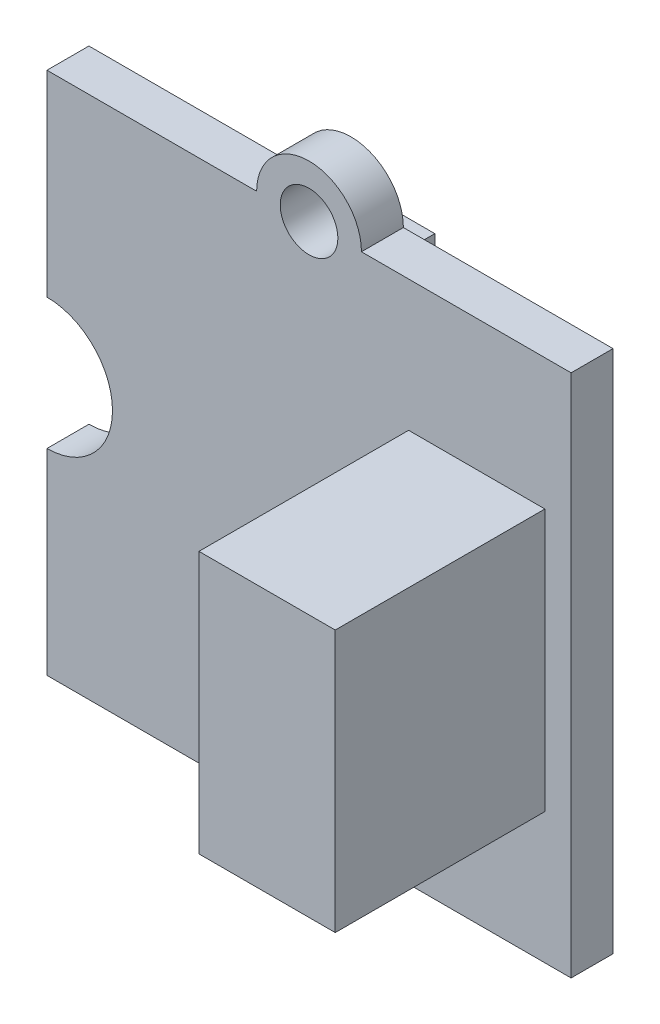
ISO-10303-21;
HEADER;
FILE_DESCRIPTION(('STEP AP214'),'2;1');
FILE_NAME('part.step','',(''),(''),'','','');
FILE_SCHEMA(('AUTOMOTIVE_DESIGN { 1 0 10303 214 1 1 1 1 }'));
ENDSEC;
DATA;
#1=APPLICATION_CONTEXT('core data for automotive mechanical design processes');
#2=APPLICATION_PROTOCOL_DEFINITION('international standard','automotive_design',2000,#1);
#3=PRODUCT_CONTEXT('',#1,'mechanical');
#4=PRODUCT('Part','Part','',(#3));
#5=PRODUCT_RELATED_PRODUCT_CATEGORY('part','',(#4));
#6=PRODUCT_DEFINITION_FORMATION('','',#4);
#7=PRODUCT_DEFINITION_CONTEXT('part definition',#1,'design');
#8=PRODUCT_DEFINITION('design','',#6,#7);
#9=PRODUCT_DEFINITION_SHAPE('','',#8);
#10=(LENGTH_UNIT() NAMED_UNIT(*) SI_UNIT(.MILLI.,.METRE.));
#11=(NAMED_UNIT(*) PLANE_ANGLE_UNIT() SI_UNIT($,.RADIAN.));
#12=(NAMED_UNIT(*) SI_UNIT($,.STERADIAN.) SOLID_ANGLE_UNIT());
#13=UNCERTAINTY_MEASURE_WITH_UNIT(LENGTH_MEASURE(1.E-05),#10,'distance_accuracy_value','');
#14=(GEOMETRIC_REPRESENTATION_CONTEXT(3) GLOBAL_UNCERTAINTY_ASSIGNED_CONTEXT((#13)) GLOBAL_UNIT_ASSIGNED_CONTEXT((#10,
#11,#12)) REPRESENTATION_CONTEXT('',''));
#15=CARTESIAN_POINT('',(0.,0.,0.));
#16=DIRECTION('',(0.,0.,1.));
#17=DIRECTION('',(1.,0.,0.));
#18=AXIS2_PLACEMENT_3D('',#15,#16,#17);
#19=CARTESIAN_POINT('',(0.,0.,1.6));
#20=DIRECTION('',(0.,0.,1.));
#21=DIRECTION('',(1.,0.,0.));
#22=AXIS2_PLACEMENT_3D('',#19,#20,#21);
#23=PLANE('',#22);
#24=CARTESIAN_POINT('',(-10.,0.,1.6));
#25=DIRECTION('',(0.,0.,1.));
#26=DIRECTION('',(1.,0.,0.));
#27=AXIS2_PLACEMENT_3D('',#24,#25,#26);
#28=CIRCLE('',#27,1.1);
#29=CARTESIAN_POINT('',(-8.9,0.,1.6));
#30=VERTEX_POINT('',#29);
#31=EDGE_CURVE('E226',#30,#30,#28,.T.);
#32=ORIENTED_EDGE('',*,*,#31,.F.);
#33=EDGE_LOOP('',(#32));
#34=FACE_BOUND('',#33,.T.);
#35=CARTESIAN_POINT('',(-10.,20.,1.6));
#36=DIRECTION('',(0.,0.,1.));
#37=DIRECTION('',(1.,0.,0.));
#38=AXIS2_PLACEMENT_3D('',#35,#36,#37);
#39=CIRCLE('',#38,2.);
#40=CARTESIAN_POINT('',(-8.,20.,1.6));
#41=VERTEX_POINT('',#40);
#42=CARTESIAN_POINT('',(-12.,20.,1.6));
#43=VERTEX_POINT('',#42);
#44=EDGE_CURVE('E229',#41,#43,#39,.T.);
#45=ORIENTED_EDGE('',*,*,#44,.T.);
#46=DIRECTION('',(-1.,0.,0.));
#47=VECTOR('',#46,1.);
#48=CARTESIAN_POINT('',(0.,20.,1.6));
#49=LINE('',#48,#47);
#50=CARTESIAN_POINT('',(-20.,20.,1.6));
#51=VERTEX_POINT('',#50);
#52=EDGE_CURVE('E233',#43,#51,#49,.T.);
#53=ORIENTED_EDGE('',*,*,#52,.T.);
#54=DIRECTION('',(0.,1.,0.));
#55=VECTOR('',#54,1.);
#56=CARTESIAN_POINT('',(-20.,0.,1.6));
#57=LINE('',#56,#55);
#58=CARTESIAN_POINT('',(-20.,12.5,1.6));
#59=VERTEX_POINT('',#58);
#60=EDGE_CURVE('E235',#59,#51,#57,.T.);
#61=ORIENTED_EDGE('',*,*,#60,.F.);
#62=CARTESIAN_POINT('',(-20.,10.,1.6));
#63=DIRECTION('',(0.,0.,1.));
#64=DIRECTION('',(1.,0.,0.));
#65=AXIS2_PLACEMENT_3D('',#62,#63,#64);
#66=CIRCLE('',#65,2.5);
#67=CARTESIAN_POINT('',(-20.,7.5,1.6));
#68=VERTEX_POINT('',#67);
#69=EDGE_CURVE('E239',#68,#59,#66,.T.);
#70=ORIENTED_EDGE('',*,*,#69,.F.);
#71=CARTESIAN_POINT('',(-20.,0.,1.6));
#72=VERTEX_POINT('',#71);
#73=EDGE_CURVE('E240',#72,#68,#57,.T.);
#74=ORIENTED_EDGE('',*,*,#73,.F.);
#75=DIRECTION('',(-1.,0.,0.));
#76=VECTOR('',#75,1.);
#77=CARTESIAN_POINT('',(0.,0.,1.6));
#78=LINE('',#77,#76);
#79=CARTESIAN_POINT('',(-12.,0.,1.6));
#80=VERTEX_POINT('',#79);
#81=EDGE_CURVE('E243',#80,#72,#78,.T.);
#82=ORIENTED_EDGE('',*,*,#81,.F.);
#83=CARTESIAN_POINT('',(-10.,0.,1.6));
#84=DIRECTION('',(0.,0.,1.));
#85=DIRECTION('',(1.,0.,0.));
#86=AXIS2_PLACEMENT_3D('',#83,#84,#85);
#87=CIRCLE('',#86,2.);
#88=CARTESIAN_POINT('',(-8.,0.,1.6));
#89=VERTEX_POINT('',#88);
#90=EDGE_CURVE('E246',#80,#89,#87,.T.);
#91=ORIENTED_EDGE('',*,*,#90,.T.);
#92=CARTESIAN_POINT('',(0.,0.,1.6));
#93=VERTEX_POINT('',#92);
#94=EDGE_CURVE('E247',#93,#89,#78,.T.);
#95=ORIENTED_EDGE('',*,*,#94,.F.);
#96=DIRECTION('',(0.,1.,0.));
#97=VECTOR('',#96,1.);
#98=CARTESIAN_POINT('',(0.,0.,1.6));
#99=LINE('',#98,#97);
#100=CARTESIAN_POINT('',(0.,20.,1.6));
#101=VERTEX_POINT('',#100);
#102=EDGE_CURVE('E249',#93,#101,#99,.T.);
#103=ORIENTED_EDGE('',*,*,#102,.T.);
#104=EDGE_CURVE('E236',#101,#41,#49,.T.);
#105=ORIENTED_EDGE('',*,*,#104,.T.);
#106=EDGE_LOOP('',(#45,#53,#61,#70,#74,#82,#91,#95,#103,#105));
#107=FACE_BOUND('',#106,.T.);
#108=CARTESIAN_POINT('',(-10.,20.,1.6));
#109=DIRECTION('',(0.,0.,1.));
#110=DIRECTION('',(1.,0.,0.));
#111=AXIS2_PLACEMENT_3D('',#108,#109,#110);
#112=CIRCLE('',#111,1.1);
#113=CARTESIAN_POINT('',(-8.9,20.,1.6));
#114=VERTEX_POINT('',#113);
#115=EDGE_CURVE('E251',#114,#114,#112,.T.);
#116=ORIENTED_EDGE('',*,*,#115,.F.);
#117=EDGE_LOOP('',(#116));
#118=FACE_BOUND('',#117,.T.);
#119=DIRECTION('',(1.,0.,0.));
#120=VECTOR('',#119,1.);
#121=CARTESIAN_POINT('',(-1.,5.,1.6));
#122=LINE('',#121,#120);
#123=CARTESIAN_POINT('',(-6.2,5.,1.6));
#124=VERTEX_POINT('',#123);
#125=CARTESIAN_POINT('',(-1.,5.,1.6));
#126=VERTEX_POINT('',#125);
#127=EDGE_CURVE('E516',#124,#126,#122,.T.);
#128=ORIENTED_EDGE('',*,*,#127,.F.);
#129=DIRECTION('',(0.,-1.,0.));
#130=VECTOR('',#129,1.);
#131=CARTESIAN_POINT('',(-6.2,5.,1.6));
#132=LINE('',#131,#130);
#133=CARTESIAN_POINT('',(-6.2,15.,1.6));
#134=VERTEX_POINT('',#133);
#135=EDGE_CURVE('E189',#134,#124,#132,.T.);
#136=ORIENTED_EDGE('',*,*,#135,.F.);
#137=DIRECTION('',(-1.,0.,0.));
#138=VECTOR('',#137,1.);
#139=CARTESIAN_POINT('',(-1.,15.,1.6));
#140=LINE('',#139,#138);
#141=CARTESIAN_POINT('',(-1.,15.,1.6));
#142=VERTEX_POINT('',#141);
#143=EDGE_CURVE('E185',#142,#134,#140,.T.);
#144=ORIENTED_EDGE('',*,*,#143,.F.);
#145=DIRECTION('',(0.,1.,0.));
#146=VECTOR('',#145,1.);
#147=CARTESIAN_POINT('',(-1.,5.,1.6));
#148=LINE('',#147,#146);
#149=EDGE_CURVE('E513',#126,#142,#148,.T.);
#150=ORIENTED_EDGE('',*,*,#149,.F.);
#151=EDGE_LOOP('',(#128,#136,#144,#150));
#152=FACE_BOUND('',#151,.T.);
#153=ADVANCED_FACE('F41',(#34,#107,#118,#152),#23,.T.);
#154=CARTESIAN_POINT('',(0.,0.,0.));
#155=DIRECTION('',(0.,0.,1.));
#156=DIRECTION('',(1.,0.,0.));
#157=AXIS2_PLACEMENT_3D('',#154,#155,#156);
#158=PLANE('',#157);
#159=CARTESIAN_POINT('',(-10.,20.,0.));
#160=DIRECTION('',(0.,0.,1.));
#161=DIRECTION('',(1.,0.,0.));
#162=AXIS2_PLACEMENT_3D('',#159,#160,#161);
#163=CIRCLE('',#162,1.1);
#164=CARTESIAN_POINT('',(-8.9,20.,0.));
#165=VERTEX_POINT('',#164);
#166=EDGE_CURVE('E230',#165,#165,#163,.T.);
#167=ORIENTED_EDGE('',*,*,#166,.T.);
#168=EDGE_LOOP('',(#167));
#169=FACE_BOUND('',#168,.T.);
#170=CARTESIAN_POINT('',(-10.,20.,0.));
#171=DIRECTION('',(0.,0.,1.));
#172=DIRECTION('',(1.,0.,0.));
#173=AXIS2_PLACEMENT_3D('',#170,#171,#172);
#174=CIRCLE('',#173,2.);
#175=CARTESIAN_POINT('',(-8.,20.,0.));
#176=VERTEX_POINT('',#175);
#177=CARTESIAN_POINT('',(-12.,20.,0.));
#178=VERTEX_POINT('',#177);
#179=EDGE_CURVE('E257',#176,#178,#174,.T.);
#180=ORIENTED_EDGE('',*,*,#179,.F.);
#181=DIRECTION('',(-1.,0.,0.));
#182=VECTOR('',#181,1.);
#183=CARTESIAN_POINT('',(0.,20.,0.));
#184=LINE('',#183,#182);
#185=CARTESIAN_POINT('',(0.,20.,0.));
#186=VERTEX_POINT('',#185);
#187=EDGE_CURVE('E264',#186,#176,#184,.T.);
#188=ORIENTED_EDGE('',*,*,#187,.F.);
#189=DIRECTION('',(0.,1.,0.));
#190=VECTOR('',#189,1.);
#191=CARTESIAN_POINT('',(0.,0.,0.));
#192=LINE('',#191,#190);
#193=CARTESIAN_POINT('',(0.,0.,0.));
#194=VERTEX_POINT('',#193);
#195=EDGE_CURVE('E278',#194,#186,#192,.T.);
#196=ORIENTED_EDGE('',*,*,#195,.F.);
#197=DIRECTION('',(-1.,0.,0.));
#198=VECTOR('',#197,1.);
#199=CARTESIAN_POINT('',(0.,0.,0.));
#200=LINE('',#199,#198);
#201=CARTESIAN_POINT('',(-8.,0.,0.));
#202=VERTEX_POINT('',#201);
#203=EDGE_CURVE('E275',#194,#202,#200,.T.);
#204=ORIENTED_EDGE('',*,*,#203,.T.);
#205=CARTESIAN_POINT('',(-10.,0.,0.));
#206=DIRECTION('',(0.,0.,1.));
#207=DIRECTION('',(1.,0.,0.));
#208=AXIS2_PLACEMENT_3D('',#205,#206,#207);
#209=CIRCLE('',#208,2.);
#210=CARTESIAN_POINT('',(-12.,0.,0.));
#211=VERTEX_POINT('',#210);
#212=EDGE_CURVE('E274',#211,#202,#209,.T.);
#213=ORIENTED_EDGE('',*,*,#212,.F.);
#214=CARTESIAN_POINT('',(-20.,0.,0.));
#215=VERTEX_POINT('',#214);
#216=EDGE_CURVE('E271',#211,#215,#200,.T.);
#217=ORIENTED_EDGE('',*,*,#216,.T.);
#218=DIRECTION('',(0.,1.,0.));
#219=VECTOR('',#218,1.);
#220=CARTESIAN_POINT('',(-20.,0.,0.));
#221=LINE('',#220,#219);
#222=CARTESIAN_POINT('',(-20.,7.5,0.));
#223=VERTEX_POINT('',#222);
#224=EDGE_CURVE('E268',#215,#223,#221,.T.);
#225=ORIENTED_EDGE('',*,*,#224,.T.);
#226=CARTESIAN_POINT('',(-20.,10.,0.));
#227=DIRECTION('',(0.,0.,1.));
#228=DIRECTION('',(1.,0.,0.));
#229=AXIS2_PLACEMENT_3D('',#226,#227,#228);
#230=CIRCLE('',#229,2.5);
#231=CARTESIAN_POINT('',(-20.,12.5,0.));
#232=VERTEX_POINT('',#231);
#233=EDGE_CURVE('E267',#223,#232,#230,.T.);
#234=ORIENTED_EDGE('',*,*,#233,.T.);
#235=CARTESIAN_POINT('',(-20.,20.,0.));
#236=VERTEX_POINT('',#235);
#237=EDGE_CURVE('E263',#232,#236,#221,.T.);
#238=ORIENTED_EDGE('',*,*,#237,.T.);
#239=EDGE_CURVE('E260',#178,#236,#184,.T.);
#240=ORIENTED_EDGE('',*,*,#239,.F.);
#241=EDGE_LOOP('',(#180,#188,#196,#204,#213,#217,#225,#234,#238,#240));
#242=FACE_BOUND('',#241,.T.);
#243=CARTESIAN_POINT('',(-10.,0.,0.));
#244=DIRECTION('',(0.,0.,1.));
#245=DIRECTION('',(1.,0.,0.));
#246=AXIS2_PLACEMENT_3D('',#243,#244,#245);
#247=CIRCLE('',#246,1.1);
#248=CARTESIAN_POINT('',(-8.9,0.,0.));
#249=VERTEX_POINT('',#248);
#250=EDGE_CURVE('E225',#249,#249,#247,.T.);
#251=ORIENTED_EDGE('',*,*,#250,.T.);
#252=EDGE_LOOP('',(#251));
#253=FACE_BOUND('',#252,.T.);
#254=DIRECTION('',(0.,1.,0.));
#255=VECTOR('',#254,1.);
#256=CARTESIAN_POINT('',(-17.4,14.4,0.));
#257=LINE('',#256,#255);
#258=CARTESIAN_POINT('',(-17.4,5.6,0.));
#259=VERTEX_POINT('',#258);
#260=CARTESIAN_POINT('',(-17.4,14.4,0.));
#261=VERTEX_POINT('',#260);
#262=EDGE_CURVE('E191',#259,#261,#257,.T.);
#263=ORIENTED_EDGE('',*,*,#262,.F.);
#264=DIRECTION('',(-1.,0.,0.));
#265=VECTOR('',#264,1.);
#266=CARTESIAN_POINT('',(-12.8,5.6,0.));
#267=LINE('',#266,#265);
#268=CARTESIAN_POINT('',(-12.8,5.6,0.));
#269=VERTEX_POINT('',#268);
#270=EDGE_CURVE('E202',#269,#259,#267,.T.);
#271=ORIENTED_EDGE('',*,*,#270,.F.);
#272=DIRECTION('',(0.,-1.,0.));
#273=VECTOR('',#272,1.);
#274=CARTESIAN_POINT('',(-12.8,14.4,0.));
#275=LINE('',#274,#273);
#276=CARTESIAN_POINT('',(-12.8,14.4,0.));
#277=VERTEX_POINT('',#276);
#278=EDGE_CURVE('E210',#277,#269,#275,.T.);
#279=ORIENTED_EDGE('',*,*,#278,.F.);
#280=DIRECTION('',(1.,0.,0.));
#281=VECTOR('',#280,1.);
#282=CARTESIAN_POINT('',(-12.8,14.4,0.));
#283=LINE('',#282,#281);
#284=EDGE_CURVE('E64',#261,#277,#283,.T.);
#285=ORIENTED_EDGE('',*,*,#284,.F.);
#286=EDGE_LOOP('',(#263,#271,#279,#285));
#287=FACE_BOUND('',#286,.T.);
#288=ADVANCED_FACE('F308',(#169,#242,#253,#287),#158,.F.);
#289=CARTESIAN_POINT('',(-10.,20.,1.6));
#290=DIRECTION('',(0.,0.,-1.));
#291=DIRECTION('',(-1.,0.,0.));
#292=AXIS2_PLACEMENT_3D('',#289,#290,#291);
#293=CYLINDRICAL_SURFACE('',#292,2.);
#294=ORIENTED_EDGE('',*,*,#179,.T.);
#295=DIRECTION('',(0.,0.,-1.));
#296=VECTOR('',#295,1.);
#297=CARTESIAN_POINT('',(-12.,20.,1.6));
#298=LINE('',#297,#296);
#299=EDGE_CURVE('E11',#43,#178,#298,.T.);
#300=ORIENTED_EDGE('',*,*,#299,.F.);
#301=ORIENTED_EDGE('',*,*,#44,.F.);
#302=DIRECTION('',(0.,0.,-1.));
#303=VECTOR('',#302,1.);
#304=CARTESIAN_POINT('',(-8.,20.,1.6));
#305=LINE('',#304,#303);
#306=EDGE_CURVE('E254',#41,#176,#305,.T.);
#307=ORIENTED_EDGE('',*,*,#306,.T.);
#308=EDGE_LOOP('',(#294,#300,#301,#307));
#309=FACE_BOUND('',#308,.T.);
#310=ADVANCED_FACE('F324',(#309),#293,.T.);
#311=CARTESIAN_POINT('',(0.,20.,1.6));
#312=DIRECTION('',(0.,-1.,0.));
#313=DIRECTION('',(0.,0.,-1.));
#314=AXIS2_PLACEMENT_3D('',#311,#312,#313);
#315=PLANE('',#314);
#316=ORIENTED_EDGE('',*,*,#239,.T.);
#317=DIRECTION('',(0.,0.,-1.));
#318=VECTOR('',#317,1.);
#319=CARTESIAN_POINT('',(-20.,20.,1.6));
#320=LINE('',#319,#318);
#321=EDGE_CURVE('E49',#51,#236,#320,.T.);
#322=ORIENTED_EDGE('',*,*,#321,.F.);
#323=ORIENTED_EDGE('',*,*,#52,.F.);
#324=ORIENTED_EDGE('',*,*,#299,.T.);
#325=EDGE_LOOP('',(#316,#322,#323,#324));
#326=FACE_BOUND('',#325,.T.);
#327=ADVANCED_FACE('F304',(#326),#315,.F.);
#328=CARTESIAN_POINT('',(-20.,0.,1.6));
#329=DIRECTION('',(-1.,0.,0.));
#330=DIRECTION('',(0.,0.,1.));
#331=AXIS2_PLACEMENT_3D('',#328,#329,#330);
#332=PLANE('',#331);
#333=ORIENTED_EDGE('',*,*,#237,.F.);
#334=DIRECTION('',(0.,0.,-1.));
#335=VECTOR('',#334,1.);
#336=CARTESIAN_POINT('',(-20.,12.5,1.6));
#337=LINE('',#336,#335);
#338=EDGE_CURVE('E297',#59,#232,#337,.T.);
#339=ORIENTED_EDGE('',*,*,#338,.F.);
#340=ORIENTED_EDGE('',*,*,#60,.T.);
#341=ORIENTED_EDGE('',*,*,#321,.T.);
#342=EDGE_LOOP('',(#333,#339,#340,#341));
#343=FACE_BOUND('',#342,.T.);
#344=ADVANCED_FACE('F301',(#343),#332,.T.);
#345=CARTESIAN_POINT('',(-20.,10.,1.6));
#346=DIRECTION('',(0.,0.,-1.));
#347=DIRECTION('',(-1.,0.,0.));
#348=AXIS2_PLACEMENT_3D('',#345,#346,#347);
#349=CYLINDRICAL_SURFACE('',#348,2.5);
#350=ORIENTED_EDGE('',*,*,#233,.F.);
#351=DIRECTION('',(0.,0.,-1.));
#352=VECTOR('',#351,1.);
#353=CARTESIAN_POINT('',(-20.,7.5,1.6));
#354=LINE('',#353,#352);
#355=EDGE_CURVE('E295',#68,#223,#354,.T.);
#356=ORIENTED_EDGE('',*,*,#355,.F.);
#357=ORIENTED_EDGE('',*,*,#69,.T.);
#358=ORIENTED_EDGE('',*,*,#338,.T.);
#359=EDGE_LOOP('',(#350,#356,#357,#358));
#360=FACE_BOUND('',#359,.T.);
#361=ADVANCED_FACE('F314',(#360),#349,.F.);
#362=ORIENTED_EDGE('',*,*,#224,.F.);
#363=DIRECTION('',(0.,0.,-1.));
#364=VECTOR('',#363,1.);
#365=CARTESIAN_POINT('',(-20.,0.,1.6));
#366=LINE('',#365,#364);
#367=EDGE_CURVE('E293',#72,#215,#366,.T.);
#368=ORIENTED_EDGE('',*,*,#367,.F.);
#369=ORIENTED_EDGE('',*,*,#73,.T.);
#370=ORIENTED_EDGE('',*,*,#355,.T.);
#371=EDGE_LOOP('',(#362,#368,#369,#370));
#372=FACE_BOUND('',#371,.T.);
#373=ADVANCED_FACE('F348',(#372),#332,.T.);
#374=CARTESIAN_POINT('',(0.,0.,1.6));
#375=DIRECTION('',(0.,-1.,0.));
#376=DIRECTION('',(0.,0.,-1.));
#377=AXIS2_PLACEMENT_3D('',#374,#375,#376);
#378=PLANE('',#377);
#379=ORIENTED_EDGE('',*,*,#216,.F.);
#380=DIRECTION('',(0.,0.,-1.));
#381=VECTOR('',#380,1.);
#382=CARTESIAN_POINT('',(-12.,0.,1.6));
#383=LINE('',#382,#381);
#384=EDGE_CURVE('E291',#80,#211,#383,.T.);
#385=ORIENTED_EDGE('',*,*,#384,.F.);
#386=ORIENTED_EDGE('',*,*,#81,.T.);
#387=ORIENTED_EDGE('',*,*,#367,.T.);
#388=EDGE_LOOP('',(#379,#385,#386,#387));
#389=FACE_BOUND('',#388,.T.);
#390=ADVANCED_FACE('F344',(#389),#378,.T.);
#391=CARTESIAN_POINT('',(-10.,0.,1.6));
#392=DIRECTION('',(0.,0.,-1.));
#393=DIRECTION('',(-1.,0.,0.));
#394=AXIS2_PLACEMENT_3D('',#391,#392,#393);
#395=CYLINDRICAL_SURFACE('',#394,2.);
#396=ORIENTED_EDGE('',*,*,#212,.T.);
#397=DIRECTION('',(0.,0.,-1.));
#398=VECTOR('',#397,1.);
#399=CARTESIAN_POINT('',(-8.,0.,1.6));
#400=LINE('',#399,#398);
#401=EDGE_CURVE('E289',#89,#202,#400,.T.);
#402=ORIENTED_EDGE('',*,*,#401,.F.);
#403=ORIENTED_EDGE('',*,*,#90,.F.);
#404=ORIENTED_EDGE('',*,*,#384,.T.);
#405=EDGE_LOOP('',(#396,#402,#403,#404));
#406=FACE_BOUND('',#405,.T.);
#407=ADVANCED_FACE('F349',(#406),#395,.T.);
#408=ORIENTED_EDGE('',*,*,#203,.F.);
#409=DIRECTION('',(0.,0.,-1.));
#410=VECTOR('',#409,1.);
#411=CARTESIAN_POINT('',(0.,0.,1.6));
#412=LINE('',#411,#410);
#413=EDGE_CURVE('E287',#93,#194,#412,.T.);
#414=ORIENTED_EDGE('',*,*,#413,.F.);
#415=ORIENTED_EDGE('',*,*,#94,.T.);
#416=ORIENTED_EDGE('',*,*,#401,.T.);
#417=EDGE_LOOP('',(#408,#414,#415,#416));
#418=FACE_BOUND('',#417,.T.);
#419=ADVANCED_FACE('F338',(#418),#378,.T.);
#420=CARTESIAN_POINT('',(0.,0.,1.6));
#421=DIRECTION('',(-1.,0.,0.));
#422=DIRECTION('',(0.,0.,1.));
#423=AXIS2_PLACEMENT_3D('',#420,#421,#422);
#424=PLANE('',#423);
#425=ORIENTED_EDGE('',*,*,#195,.T.);
#426=DIRECTION('',(0.,0.,-1.));
#427=VECTOR('',#426,1.);
#428=CARTESIAN_POINT('',(0.,20.,1.6));
#429=LINE('',#428,#427);
#430=EDGE_CURVE('E284',#101,#186,#429,.T.);
#431=ORIENTED_EDGE('',*,*,#430,.F.);
#432=ORIENTED_EDGE('',*,*,#102,.F.);
#433=ORIENTED_EDGE('',*,*,#413,.T.);
#434=EDGE_LOOP('',(#425,#431,#432,#433));
#435=FACE_BOUND('',#434,.T.);
#436=ADVANCED_FACE('F334',(#435),#424,.F.);
#437=ORIENTED_EDGE('',*,*,#187,.T.);
#438=ORIENTED_EDGE('',*,*,#306,.F.);
#439=ORIENTED_EDGE('',*,*,#104,.F.);
#440=ORIENTED_EDGE('',*,*,#430,.T.);
#441=EDGE_LOOP('',(#437,#438,#439,#440));
#442=FACE_BOUND('',#441,.T.);
#443=ADVANCED_FACE('F330',(#442),#315,.F.);
#444=CARTESIAN_POINT('',(-10.,0.,1.6));
#445=DIRECTION('',(0.,0.,-1.));
#446=DIRECTION('',(-1.,0.,0.));
#447=AXIS2_PLACEMENT_3D('',#444,#445,#446);
#448=CYLINDRICAL_SURFACE('',#447,1.1);
#449=ORIENTED_EDGE('',*,*,#31,.T.);
#450=EDGE_LOOP('',(#449));
#451=FACE_BOUND('',#450,.T.);
#452=ORIENTED_EDGE('',*,*,#250,.F.);
#453=EDGE_LOOP('',(#452));
#454=FACE_BOUND('',#453,.T.);
#455=ADVANCED_FACE('F43',(#451,#454),#448,.F.);
#456=CARTESIAN_POINT('',(-10.,20.,1.6));
#457=DIRECTION('',(0.,0.,-1.));
#458=DIRECTION('',(-1.,0.,0.));
#459=AXIS2_PLACEMENT_3D('',#456,#457,#458);
#460=CYLINDRICAL_SURFACE('',#459,1.1);
#461=ORIENTED_EDGE('',*,*,#115,.T.);
#462=EDGE_LOOP('',(#461));
#463=FACE_BOUND('',#462,.T.);
#464=ORIENTED_EDGE('',*,*,#166,.F.);
#465=EDGE_LOOP('',(#464));
#466=FACE_BOUND('',#465,.T.);
#467=ADVANCED_FACE('F373',(#463,#466),#460,.F.);
#468=CARTESIAN_POINT('',(-17.4,14.4,-6.));
#469=DIRECTION('',(1.,0.,0.));
#470=DIRECTION('',(0.,0.,-1.));
#471=AXIS2_PLACEMENT_3D('',#468,#469,#470);
#472=PLANE('',#471);
#473=ORIENTED_EDGE('',*,*,#262,.T.);
#474=DIRECTION('',(0.,0.,1.));
#475=VECTOR('',#474,1.);
#476=CARTESIAN_POINT('',(-17.4,14.4,-6.));
#477=LINE('',#476,#475);
#478=CARTESIAN_POINT('',(-17.4,14.4,-6.));
#479=VERTEX_POINT('',#478);
#480=EDGE_CURVE('E223',#479,#261,#477,.T.);
#481=ORIENTED_EDGE('',*,*,#480,.F.);
#482=DIRECTION('',(0.,1.,0.));
#483=VECTOR('',#482,1.);
#484=CARTESIAN_POINT('',(-17.4,14.4,-6.));
#485=LINE('',#484,#483);
#486=CARTESIAN_POINT('',(-17.4,5.6,-6.));
#487=VERTEX_POINT('',#486);
#488=EDGE_CURVE('E198',#487,#479,#485,.T.);
#489=ORIENTED_EDGE('',*,*,#488,.F.);
#490=DIRECTION('',(0.,0.,1.));
#491=VECTOR('',#490,1.);
#492=CARTESIAN_POINT('',(-17.4,5.6,-6.));
#493=LINE('',#492,#491);
#494=EDGE_CURVE('E207',#487,#259,#493,.T.);
#495=ORIENTED_EDGE('',*,*,#494,.T.);
#496=EDGE_LOOP('',(#473,#481,#489,#495));
#497=FACE_BOUND('',#496,.T.);
#498=ADVANCED_FACE('F370',(#497),#472,.F.);
#499=CARTESIAN_POINT('',(-12.8,14.4,-6.));
#500=DIRECTION('',(0.,-1.,0.));
#501=DIRECTION('',(0.,0.,-1.));
#502=AXIS2_PLACEMENT_3D('',#499,#500,#501);
#503=PLANE('',#502);
#504=ORIENTED_EDGE('',*,*,#284,.T.);
#505=DIRECTION('',(0.,0.,1.));
#506=VECTOR('',#505,1.);
#507=CARTESIAN_POINT('',(-12.8,14.4,-6.));
#508=LINE('',#507,#506);
#509=CARTESIAN_POINT('',(-12.8,14.4,-6.));
#510=VERTEX_POINT('',#509);
#511=EDGE_CURVE('E220',#510,#277,#508,.T.);
#512=ORIENTED_EDGE('',*,*,#511,.F.);
#513=DIRECTION('',(1.,0.,0.));
#514=VECTOR('',#513,1.);
#515=CARTESIAN_POINT('',(-12.8,14.4,-6.));
#516=LINE('',#515,#514);
#517=EDGE_CURVE('E201',#479,#510,#516,.T.);
#518=ORIENTED_EDGE('',*,*,#517,.F.);
#519=ORIENTED_EDGE('',*,*,#480,.T.);
#520=EDGE_LOOP('',(#504,#512,#518,#519));
#521=FACE_BOUND('',#520,.T.);
#522=ADVANCED_FACE('F414',(#521),#503,.F.);
#523=CARTESIAN_POINT('',(-12.8,14.4,-6.));
#524=DIRECTION('',(-1.,0.,0.));
#525=DIRECTION('',(0.,-1.,0.));
#526=AXIS2_PLACEMENT_3D('',#523,#524,#525);
#527=PLANE('',#526);
#528=ORIENTED_EDGE('',*,*,#278,.T.);
#529=DIRECTION('',(0.,0.,1.));
#530=VECTOR('',#529,1.);
#531=CARTESIAN_POINT('',(-12.8,5.6,-6.));
#532=LINE('',#531,#530);
#533=CARTESIAN_POINT('',(-12.8,5.6,-6.));
#534=VERTEX_POINT('',#533);
#535=EDGE_CURVE('E217',#534,#269,#532,.T.);
#536=ORIENTED_EDGE('',*,*,#535,.F.);
#537=DIRECTION('',(0.,-1.,0.));
#538=VECTOR('',#537,1.);
#539=CARTESIAN_POINT('',(-12.8,14.4,-6.));
#540=LINE('',#539,#538);
#541=EDGE_CURVE('E204',#510,#534,#540,.T.);
#542=ORIENTED_EDGE('',*,*,#541,.F.);
#543=ORIENTED_EDGE('',*,*,#511,.T.);
#544=EDGE_LOOP('',(#528,#536,#542,#543));
#545=FACE_BOUND('',#544,.T.);
#546=ADVANCED_FACE('F421',(#545),#527,.F.);
#547=CARTESIAN_POINT('',(-12.8,5.6,-6.));
#548=DIRECTION('',(0.,1.,0.));
#549=DIRECTION('',(0.,0.,1.));
#550=AXIS2_PLACEMENT_3D('',#547,#548,#549);
#551=PLANE('',#550);
#552=ORIENTED_EDGE('',*,*,#270,.T.);
#553=ORIENTED_EDGE('',*,*,#494,.F.);
#554=DIRECTION('',(-1.,0.,0.));
#555=VECTOR('',#554,1.);
#556=CARTESIAN_POINT('',(-12.8,5.6,-6.));
#557=LINE('',#556,#555);
#558=EDGE_CURVE('E206',#534,#487,#557,.T.);
#559=ORIENTED_EDGE('',*,*,#558,.F.);
#560=ORIENTED_EDGE('',*,*,#535,.T.);
#561=EDGE_LOOP('',(#552,#553,#559,#560));
#562=FACE_BOUND('',#561,.T.);
#563=ADVANCED_FACE('F429',(#562),#551,.F.);
#564=CARTESIAN_POINT('',(0.,0.,-6.));
#565=DIRECTION('',(0.,0.,-1.));
#566=DIRECTION('',(-1.,0.,0.));
#567=AXIS2_PLACEMENT_3D('',#564,#565,#566);
#568=PLANE('',#567);
#569=ORIENTED_EDGE('',*,*,#488,.T.);
#570=ORIENTED_EDGE('',*,*,#517,.T.);
#571=ORIENTED_EDGE('',*,*,#541,.T.);
#572=ORIENTED_EDGE('',*,*,#558,.T.);
#573=EDGE_LOOP('',(#569,#570,#571,#572));
#574=FACE_BOUND('',#573,.T.);
#575=ADVANCED_FACE('F437',(#574),#568,.T.);
#576=CARTESIAN_POINT('',(-6.2,5.,9.6));
#577=DIRECTION('',(1.,0.,0.));
#578=DIRECTION('',(0.,0.,-1.));
#579=AXIS2_PLACEMENT_3D('',#576,#577,#578);
#580=PLANE('',#579);
#581=ORIENTED_EDGE('',*,*,#135,.T.);
#582=DIRECTION('',(0.,0.,-1.));
#583=VECTOR('',#582,1.);
#584=CARTESIAN_POINT('',(-6.2,5.,9.6));
#585=LINE('',#584,#583);
#586=CARTESIAN_POINT('',(-6.2,5.,9.6));
#587=VERTEX_POINT('',#586);
#588=EDGE_CURVE('E170',#587,#124,#585,.T.);
#589=ORIENTED_EDGE('',*,*,#588,.F.);
#590=DIRECTION('',(0.,-1.,0.));
#591=VECTOR('',#590,1.);
#592=CARTESIAN_POINT('',(-6.2,5.,9.6));
#593=LINE('',#592,#591);
#594=CARTESIAN_POINT('',(-6.2,15.,9.6));
#595=VERTEX_POINT('',#594);
#596=EDGE_CURVE('E177',#595,#587,#593,.T.);
#597=ORIENTED_EDGE('',*,*,#596,.F.);
#598=DIRECTION('',(0.,0.,-1.));
#599=VECTOR('',#598,1.);
#600=CARTESIAN_POINT('',(-6.2,15.,9.6));
#601=LINE('',#600,#599);
#602=EDGE_CURVE('E510',#595,#134,#601,.T.);
#603=ORIENTED_EDGE('',*,*,#602,.T.);
#604=EDGE_LOOP('',(#581,#589,#597,#603));
#605=FACE_BOUND('',#604,.T.);
#606=ADVANCED_FACE('F187',(#605),#580,.F.);
#607=CARTESIAN_POINT('',(-1.,5.,9.6));
#608=DIRECTION('',(0.,1.,0.));
#609=DIRECTION('',(-1.,0.,0.));
#610=AXIS2_PLACEMENT_3D('',#607,#608,#609);
#611=PLANE('',#610);
#612=ORIENTED_EDGE('',*,*,#127,.T.);
#613=DIRECTION('',(0.,0.,-1.));
#614=VECTOR('',#613,1.);
#615=CARTESIAN_POINT('',(-1.,5.,9.6));
#616=LINE('',#615,#614);
#617=CARTESIAN_POINT('',(-1.,5.,9.6));
#618=VERTEX_POINT('',#617);
#619=EDGE_CURVE('E173',#618,#126,#616,.T.);
#620=ORIENTED_EDGE('',*,*,#619,.F.);
#621=DIRECTION('',(1.,0.,0.));
#622=VECTOR('',#621,1.);
#623=CARTESIAN_POINT('',(-1.,5.,9.6));
#624=LINE('',#623,#622);
#625=EDGE_CURVE('E166',#587,#618,#624,.T.);
#626=ORIENTED_EDGE('',*,*,#625,.F.);
#627=ORIENTED_EDGE('',*,*,#588,.T.);
#628=EDGE_LOOP('',(#612,#620,#626,#627));
#629=FACE_BOUND('',#628,.T.);
#630=ADVANCED_FACE('F168',(#629),#611,.F.);
#631=CARTESIAN_POINT('',(-1.,5.,9.6));
#632=DIRECTION('',(-1.,0.,0.));
#633=DIRECTION('',(0.,0.,1.));
#634=AXIS2_PLACEMENT_3D('',#631,#632,#633);
#635=PLANE('',#634);
#636=ORIENTED_EDGE('',*,*,#149,.T.);
#637=DIRECTION('',(0.,0.,-1.));
#638=VECTOR('',#637,1.);
#639=CARTESIAN_POINT('',(-1.,15.,9.6));
#640=LINE('',#639,#638);
#641=CARTESIAN_POINT('',(-1.,15.,9.6));
#642=VERTEX_POINT('',#641);
#643=EDGE_CURVE('E56',#642,#142,#640,.T.);
#644=ORIENTED_EDGE('',*,*,#643,.F.);
#645=DIRECTION('',(0.,1.,0.));
#646=VECTOR('',#645,1.);
#647=CARTESIAN_POINT('',(-1.,5.,9.6));
#648=LINE('',#647,#646);
#649=EDGE_CURVE('E176',#618,#642,#648,.T.);
#650=ORIENTED_EDGE('',*,*,#649,.F.);
#651=ORIENTED_EDGE('',*,*,#619,.T.);
#652=EDGE_LOOP('',(#636,#644,#650,#651));
#653=FACE_BOUND('',#652,.T.);
#654=ADVANCED_FACE('F480',(#653),#635,.F.);
#655=CARTESIAN_POINT('',(-1.,15.,9.6));
#656=DIRECTION('',(0.,-1.,0.));
#657=DIRECTION('',(0.,0.,-1.));
#658=AXIS2_PLACEMENT_3D('',#655,#656,#657);
#659=PLANE('',#658);
#660=ORIENTED_EDGE('',*,*,#143,.T.);
#661=ORIENTED_EDGE('',*,*,#602,.F.);
#662=DIRECTION('',(-1.,0.,0.));
#663=VECTOR('',#662,1.);
#664=CARTESIAN_POINT('',(-1.,15.,9.6));
#665=LINE('',#664,#663);
#666=EDGE_CURVE('E181',#642,#595,#665,.T.);
#667=ORIENTED_EDGE('',*,*,#666,.F.);
#668=ORIENTED_EDGE('',*,*,#643,.T.);
#669=EDGE_LOOP('',(#660,#661,#667,#668));
#670=FACE_BOUND('',#669,.T.);
#671=ADVANCED_FACE('F489',(#670),#659,.F.);
#672=CARTESIAN_POINT('',(0.,0.,9.6));
#673=DIRECTION('',(0.,0.,1.));
#674=DIRECTION('',(1.,0.,0.));
#675=AXIS2_PLACEMENT_3D('',#672,#673,#674);
#676=PLANE('',#675);
#677=ORIENTED_EDGE('',*,*,#596,.T.);
#678=ORIENTED_EDGE('',*,*,#625,.T.);
#679=ORIENTED_EDGE('',*,*,#649,.T.);
#680=ORIENTED_EDGE('',*,*,#666,.T.);
#681=EDGE_LOOP('',(#677,#678,#679,#680));
#682=FACE_BOUND('',#681,.T.);
#683=ADVANCED_FACE('F180',(#682),#676,.T.);
#684=CLOSED_SHELL('',(#153,#288,#310,#327,#344,#361,#373,#390,#407,#419,#436,#443,#455,#467,
#498,#522,#546,#563,#575,#606,#630,#654,#671,#683));
#685=MANIFOLD_SOLID_BREP('B2',#684);
#686=ADVANCED_BREP_SHAPE_REPRESENTATION('',(#18,#685),#14);
#687=SHAPE_DEFINITION_REPRESENTATION(#9,#686);
ENDSEC;
END-ISO-10303-21;
